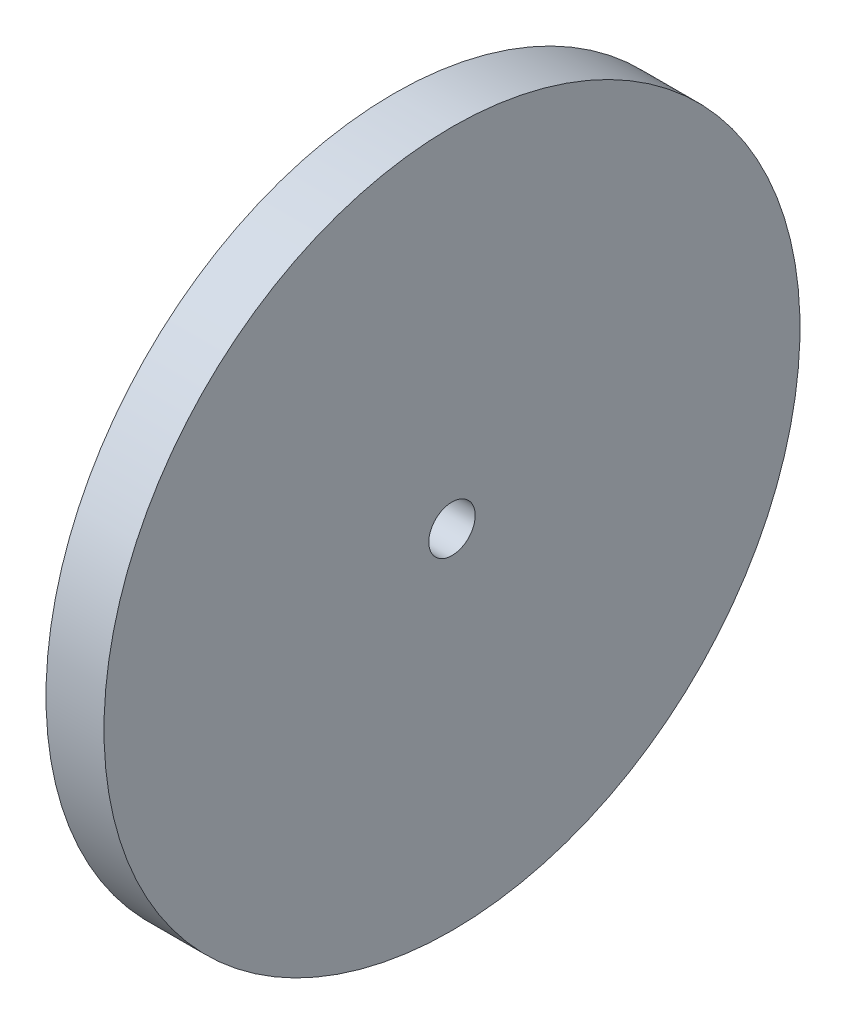
ISO-10303-21;
HEADER;
FILE_DESCRIPTION(('STEP AP214'),'2;1');
FILE_NAME('part.step','',(''),(''),'','','');
FILE_SCHEMA(('AUTOMOTIVE_DESIGN { 1 0 10303 214 1 1 1 1 }'));
ENDSEC;
DATA;
#1=APPLICATION_CONTEXT('core data for automotive mechanical design processes');
#2=APPLICATION_PROTOCOL_DEFINITION('international standard','automotive_design',2000,#1);
#3=PRODUCT_CONTEXT('',#1,'mechanical');
#4=PRODUCT('Part','Part','',(#3));
#5=PRODUCT_RELATED_PRODUCT_CATEGORY('part','',(#4));
#6=PRODUCT_DEFINITION_FORMATION('','',#4);
#7=PRODUCT_DEFINITION_CONTEXT('part definition',#1,'design');
#8=PRODUCT_DEFINITION('design','',#6,#7);
#9=PRODUCT_DEFINITION_SHAPE('','',#8);
#10=(LENGTH_UNIT() NAMED_UNIT(*) SI_UNIT(.MILLI.,.METRE.));
#11=(NAMED_UNIT(*) PLANE_ANGLE_UNIT() SI_UNIT($,.RADIAN.));
#12=(NAMED_UNIT(*) SI_UNIT($,.STERADIAN.) SOLID_ANGLE_UNIT());
#13=UNCERTAINTY_MEASURE_WITH_UNIT(LENGTH_MEASURE(1.E-05),#10,'distance_accuracy_value','');
#14=(GEOMETRIC_REPRESENTATION_CONTEXT(3) GLOBAL_UNCERTAINTY_ASSIGNED_CONTEXT((#13)) GLOBAL_UNIT_ASSIGNED_CONTEXT((#10,
#11,#12)) REPRESENTATION_CONTEXT('',''));
#15=CARTESIAN_POINT('',(0.,0.,0.));
#16=DIRECTION('',(0.,0.,1.));
#17=DIRECTION('',(1.,0.,0.));
#18=AXIS2_PLACEMENT_3D('',#15,#16,#17);
#19=CARTESIAN_POINT('',(-12.5,0.,0.));
#20=DIRECTION('',(1.,0.,0.));
#21=DIRECTION('',(0.,0.,-1.));
#22=AXIS2_PLACEMENT_3D('',#19,#20,#21);
#23=CYLINDRICAL_SURFACE('',#22,1.);
#24=CARTESIAN_POINT('',(-12.5,0.,0.));
#25=DIRECTION('',(1.,0.,0.));
#26=DIRECTION('',(0.,0.,-1.));
#27=AXIS2_PLACEMENT_3D('',#24,#25,#26);
#28=CIRCLE('',#27,1.);
#29=CARTESIAN_POINT('',(-12.5,0.,-1.));
#30=VERTEX_POINT('',#29);
#31=EDGE_CURVE('E40',#30,#30,#28,.T.);
#32=ORIENTED_EDGE('',*,*,#31,.F.);
#33=EDGE_LOOP('',(#32));
#34=FACE_BOUND('',#33,.T.);
#35=CARTESIAN_POINT('',(-10.,0.,0.));
#36=DIRECTION('',(1.,0.,0.));
#37=DIRECTION('',(0.,1.,0.));
#38=AXIS2_PLACEMENT_3D('',#35,#36,#37);
#39=CIRCLE('',#38,1.);
#40=CARTESIAN_POINT('',(-10.,1.,0.));
#41=VERTEX_POINT('',#40);
#42=EDGE_CURVE('E36',#41,#41,#39,.F.);
#43=ORIENTED_EDGE('',*,*,#42,.F.);
#44=EDGE_LOOP('',(#43));
#45=FACE_BOUND('',#44,.T.);
#46=ADVANCED_FACE('F32',(#34,#45),#23,.F.);
#47=CARTESIAN_POINT('',(-12.5,0.,0.));
#48=DIRECTION('',(-1.,0.,0.));
#49=DIRECTION('',(0.,-1.,0.));
#50=AXIS2_PLACEMENT_3D('',#47,#48,#49);
#51=CYLINDRICAL_SURFACE('',#50,15.);
#52=CARTESIAN_POINT('',(-10.,0.,0.));
#53=DIRECTION('',(1.,0.,0.));
#54=DIRECTION('',(0.,1.,0.));
#55=AXIS2_PLACEMENT_3D('',#52,#53,#54);
#56=CIRCLE('',#55,15.);
#57=CARTESIAN_POINT('',(-10.,15.,0.));
#58=VERTEX_POINT('',#57);
#59=EDGE_CURVE('E46',#58,#58,#56,.T.);
#60=ORIENTED_EDGE('',*,*,#59,.F.);
#61=EDGE_LOOP('',(#60));
#62=FACE_BOUND('',#61,.T.);
#63=CARTESIAN_POINT('',(-12.5,0.,0.));
#64=DIRECTION('',(-1.,0.,0.));
#65=DIRECTION('',(0.,-1.,0.));
#66=AXIS2_PLACEMENT_3D('',#63,#64,#65);
#67=CIRCLE('',#66,15.);
#68=CARTESIAN_POINT('',(-12.5,-15.,0.));
#69=VERTEX_POINT('',#68);
#70=EDGE_CURVE('E10',#69,#69,#67,.T.);
#71=ORIENTED_EDGE('',*,*,#70,.F.);
#72=EDGE_LOOP('',(#71));
#73=FACE_BOUND('',#72,.T.);
#74=ADVANCED_FACE('F56',(#62,#73),#51,.T.);
#75=CARTESIAN_POINT('',(-12.5,0.,0.));
#76=DIRECTION('',(1.,0.,0.));
#77=DIRECTION('',(0.,1.,0.));
#78=AXIS2_PLACEMENT_3D('',#75,#76,#77);
#79=PLANE('',#78);
#80=ORIENTED_EDGE('',*,*,#31,.T.);
#81=EDGE_LOOP('',(#80));
#82=FACE_BOUND('',#81,.T.);
#83=ORIENTED_EDGE('',*,*,#70,.T.);
#84=EDGE_LOOP('',(#83));
#85=FACE_BOUND('',#84,.T.);
#86=ADVANCED_FACE('F34',(#82,#85),#79,.F.);
#87=CARTESIAN_POINT('',(-10.,0.,0.));
#88=DIRECTION('',(1.,0.,0.));
#89=DIRECTION('',(0.,1.,0.));
#90=AXIS2_PLACEMENT_3D('',#87,#88,#89);
#91=PLANE('',#90);
#92=ORIENTED_EDGE('',*,*,#59,.T.);
#93=EDGE_LOOP('',(#92));
#94=FACE_BOUND('',#93,.T.);
#95=ORIENTED_EDGE('',*,*,#42,.T.);
#96=EDGE_LOOP('',(#95));
#97=FACE_BOUND('',#96,.T.);
#98=ADVANCED_FACE('F53',(#94,#97),#91,.T.);
#99=CLOSED_SHELL('',(#46,#74,#86,#98));
#100=MANIFOLD_SOLID_BREP('B2',#99);
#101=ADVANCED_BREP_SHAPE_REPRESENTATION('',(#18,#100),#14);
#102=SHAPE_DEFINITION_REPRESENTATION(#9,#101);
ENDSEC;
END-ISO-10303-21;
